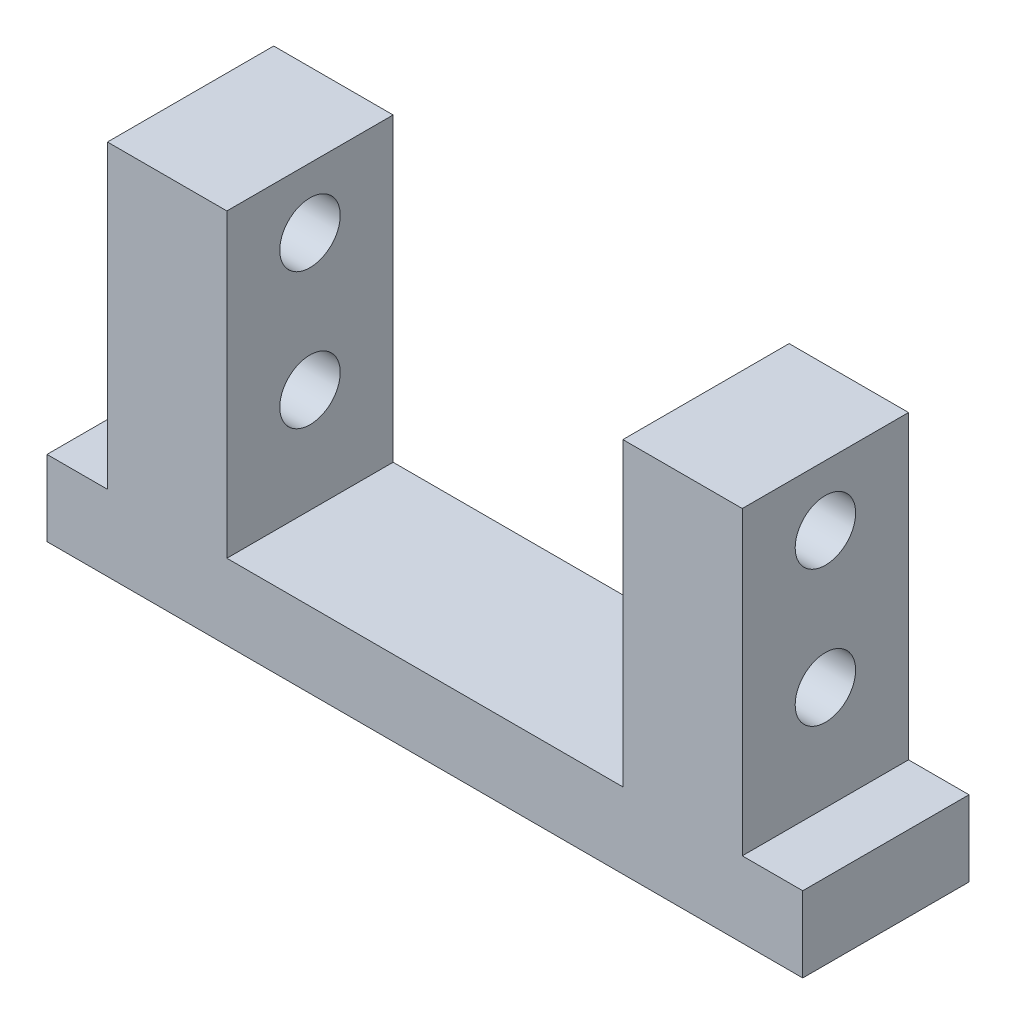
ISO-10303-21;
HEADER;
FILE_DESCRIPTION(('STEP AP214'),'2;1');
FILE_NAME('part.step','',(''),(''),'','','');
FILE_SCHEMA(('AUTOMOTIVE_DESIGN { 1 0 10303 214 1 1 1 1 }'));
ENDSEC;
DATA;
#1=APPLICATION_CONTEXT('core data for automotive mechanical design processes');
#2=APPLICATION_PROTOCOL_DEFINITION('international standard','automotive_design',2000,#1);
#3=PRODUCT_CONTEXT('',#1,'mechanical');
#4=PRODUCT('Part','Part','',(#3));
#5=PRODUCT_RELATED_PRODUCT_CATEGORY('part','',(#4));
#6=PRODUCT_DEFINITION_FORMATION('','',#4);
#7=PRODUCT_DEFINITION_CONTEXT('part definition',#1,'design');
#8=PRODUCT_DEFINITION('design','',#6,#7);
#9=PRODUCT_DEFINITION_SHAPE('','',#8);
#10=(LENGTH_UNIT() NAMED_UNIT(*) SI_UNIT(.MILLI.,.METRE.));
#11=(NAMED_UNIT(*) PLANE_ANGLE_UNIT() SI_UNIT($,.RADIAN.));
#12=(NAMED_UNIT(*) SI_UNIT($,.STERADIAN.) SOLID_ANGLE_UNIT());
#13=UNCERTAINTY_MEASURE_WITH_UNIT(LENGTH_MEASURE(1.E-05),#10,'distance_accuracy_value','');
#14=(GEOMETRIC_REPRESENTATION_CONTEXT(3) GLOBAL_UNCERTAINTY_ASSIGNED_CONTEXT((#13)) GLOBAL_UNIT_ASSIGNED_CONTEXT((#10,
#11,#12)) REPRESENTATION_CONTEXT('',''));
#15=CARTESIAN_POINT('',(0.,0.,0.));
#16=DIRECTION('',(0.,0.,1.));
#17=DIRECTION('',(1.,0.,0.));
#18=AXIS2_PLACEMENT_3D('',#15,#16,#17);
#19=CARTESIAN_POINT('',(0.,49.8,0.));
#20=DIRECTION('',(0.,1.,0.));
#21=DIRECTION('',(0.,0.,1.));
#22=AXIS2_PLACEMENT_3D('',#19,#20,#21);
#23=PLANE('',#22);
#24=DIRECTION('',(0.,0.,1.));
#25=VECTOR('',#24,1.);
#26=CARTESIAN_POINT('',(-26.2,49.8,11.));
#27=LINE('',#26,#25);
#28=CARTESIAN_POINT('',(-26.2,49.8,-11.));
#29=VERTEX_POINT('',#28);
#30=CARTESIAN_POINT('',(-26.2,49.8,11.));
#31=VERTEX_POINT('',#30);
#32=EDGE_CURVE('E131',#29,#31,#27,.T.);
#33=ORIENTED_EDGE('',*,*,#32,.F.);
#34=DIRECTION('',(-1.,0.,0.));
#35=VECTOR('',#34,1.);
#36=CARTESIAN_POINT('',(42.,49.8,-11.));
#37=LINE('',#36,#35);
#38=CARTESIAN_POINT('',(-42.,49.8,-11.));
#39=VERTEX_POINT('',#38);
#40=EDGE_CURVE('E172',#29,#39,#37,.T.);
#41=ORIENTED_EDGE('',*,*,#40,.T.);
#42=DIRECTION('',(0.,0.,1.));
#43=VECTOR('',#42,1.);
#44=CARTESIAN_POINT('',(-42.,49.8,11.));
#45=LINE('',#44,#43);
#46=CARTESIAN_POINT('',(-42.,49.8,11.));
#47=VERTEX_POINT('',#46);
#48=EDGE_CURVE('E164',#39,#47,#45,.T.);
#49=ORIENTED_EDGE('',*,*,#48,.T.);
#50=DIRECTION('',(1.,0.,0.));
#51=VECTOR('',#50,1.);
#52=CARTESIAN_POINT('',(42.,49.8,11.));
#53=LINE('',#52,#51);
#54=EDGE_CURVE('E168',#47,#31,#53,.T.);
#55=ORIENTED_EDGE('',*,*,#54,.T.);
#56=EDGE_LOOP('',(#33,#41,#49,#55));
#57=FACE_BOUND('',#56,.T.);
#58=ADVANCED_FACE('F35',(#57),#23,.T.);
#59=CARTESIAN_POINT('',(0.,10.,0.));
#60=DIRECTION('',(0.,-1.,0.));
#61=DIRECTION('',(0.,0.,-1.));
#62=AXIS2_PLACEMENT_3D('',#59,#60,#61);
#63=PLANE('',#62);
#64=DIRECTION('',(0.,0.,1.));
#65=VECTOR('',#64,1.);
#66=CARTESIAN_POINT('',(-42.,10.,11.));
#67=LINE('',#66,#65);
#68=CARTESIAN_POINT('',(-42.,10.,-11.));
#69=VERTEX_POINT('',#68);
#70=CARTESIAN_POINT('',(-42.,10.,11.));
#71=VERTEX_POINT('',#70);
#72=EDGE_CURVE('E159',#69,#71,#67,.T.);
#73=ORIENTED_EDGE('',*,*,#72,.F.);
#74=DIRECTION('',(-1.,0.,0.));
#75=VECTOR('',#74,1.);
#76=CARTESIAN_POINT('',(-50.,10.,-11.));
#77=LINE('',#76,#75);
#78=CARTESIAN_POINT('',(-50.,10.,-11.));
#79=VERTEX_POINT('',#78);
#80=EDGE_CURVE('E291',#69,#79,#77,.T.);
#81=ORIENTED_EDGE('',*,*,#80,.T.);
#82=DIRECTION('',(0.,0.,1.));
#83=VECTOR('',#82,1.);
#84=CARTESIAN_POINT('',(-50.,10.,11.));
#85=LINE('',#84,#83);
#86=CARTESIAN_POINT('',(-50.,10.,11.));
#87=VERTEX_POINT('',#86);
#88=EDGE_CURVE('E300',#79,#87,#85,.T.);
#89=ORIENTED_EDGE('',*,*,#88,.T.);
#90=DIRECTION('',(1.,0.,0.));
#91=VECTOR('',#90,1.);
#92=CARTESIAN_POINT('',(-50.,10.,11.));
#93=LINE('',#92,#91);
#94=EDGE_CURVE('E294',#87,#71,#93,.T.);
#95=ORIENTED_EDGE('',*,*,#94,.T.);
#96=EDGE_LOOP('',(#73,#81,#89,#95));
#97=FACE_BOUND('',#96,.T.);
#98=ADVANCED_FACE('F228',(#97),#63,.F.);
#99=DIRECTION('',(0.,0.,-1.));
#100=VECTOR('',#99,1.);
#101=CARTESIAN_POINT('',(42.,10.,11.));
#102=LINE('',#101,#100);
#103=CARTESIAN_POINT('',(42.,10.,11.));
#104=VERTEX_POINT('',#103);
#105=CARTESIAN_POINT('',(42.,10.,-11.));
#106=VERTEX_POINT('',#105);
#107=EDGE_CURVE('E60',#104,#106,#102,.T.);
#108=ORIENTED_EDGE('',*,*,#107,.F.);
#109=CARTESIAN_POINT('',(50.,10.,11.));
#110=VERTEX_POINT('',#109);
#111=EDGE_CURVE('E255',#104,#110,#93,.T.);
#112=ORIENTED_EDGE('',*,*,#111,.T.);
#113=DIRECTION('',(0.,0.,-1.));
#114=VECTOR('',#113,1.);
#115=CARTESIAN_POINT('',(50.,10.,11.));
#116=LINE('',#115,#114);
#117=CARTESIAN_POINT('',(50.,10.,-11.));
#118=VERTEX_POINT('',#117);
#119=EDGE_CURVE('E298',#110,#118,#116,.T.);
#120=ORIENTED_EDGE('',*,*,#119,.T.);
#121=EDGE_CURVE('E297',#118,#106,#77,.T.);
#122=ORIENTED_EDGE('',*,*,#121,.T.);
#123=EDGE_LOOP('',(#108,#112,#120,#122));
#124=FACE_BOUND('',#123,.T.);
#125=ADVANCED_FACE('F235',(#124),#63,.F.);
#126=CARTESIAN_POINT('',(50.,10.,11.));
#127=DIRECTION('',(-1.,0.,0.));
#128=DIRECTION('',(0.,0.,1.));
#129=AXIS2_PLACEMENT_3D('',#126,#127,#128);
#130=PLANE('',#129);
#131=DIRECTION('',(0.,0.,-1.));
#132=VECTOR('',#131,1.);
#133=CARTESIAN_POINT('',(50.,0.,11.));
#134=LINE('',#133,#132);
#135=CARTESIAN_POINT('',(50.,0.,11.));
#136=VERTEX_POINT('',#135);
#137=CARTESIAN_POINT('',(50.,0.,-11.));
#138=VERTEX_POINT('',#137);
#139=EDGE_CURVE('E313',#136,#138,#134,.T.);
#140=ORIENTED_EDGE('',*,*,#139,.T.);
#141=DIRECTION('',(0.,-1.,0.));
#142=VECTOR('',#141,1.);
#143=CARTESIAN_POINT('',(50.,10.,-11.));
#144=LINE('',#143,#142);
#145=EDGE_CURVE('E11',#118,#138,#144,.T.);
#146=ORIENTED_EDGE('',*,*,#145,.F.);
#147=ORIENTED_EDGE('',*,*,#119,.F.);
#148=DIRECTION('',(0.,-1.,0.));
#149=VECTOR('',#148,1.);
#150=CARTESIAN_POINT('',(50.,10.,11.));
#151=LINE('',#150,#149);
#152=EDGE_CURVE('E331',#110,#136,#151,.T.);
#153=ORIENTED_EDGE('',*,*,#152,.T.);
#154=EDGE_LOOP('',(#140,#146,#147,#153));
#155=FACE_BOUND('',#154,.T.);
#156=ADVANCED_FACE('F37',(#155),#130,.F.);
#157=CARTESIAN_POINT('',(-50.,10.,-11.));
#158=DIRECTION('',(0.,0.,1.));
#159=DIRECTION('',(1.,0.,0.));
#160=AXIS2_PLACEMENT_3D('',#157,#158,#159);
#161=PLANE('',#160);
#162=ORIENTED_EDGE('',*,*,#40,.F.);
#163=DIRECTION('',(0.,1.,0.));
#164=VECTOR('',#163,1.);
#165=CARTESIAN_POINT('',(-26.2,10.,-11.));
#166=LINE('',#165,#164);
#167=CARTESIAN_POINT('',(-26.2,10.,-11.));
#168=VERTEX_POINT('',#167);
#169=EDGE_CURVE('E157',#168,#29,#166,.T.);
#170=ORIENTED_EDGE('',*,*,#169,.F.);
#171=DIRECTION('',(-1.,0.,0.));
#172=VECTOR('',#171,1.);
#173=CARTESIAN_POINT('',(26.2,10.,-11.));
#174=LINE('',#173,#172);
#175=CARTESIAN_POINT('',(26.2,10.,-11.));
#176=VERTEX_POINT('',#175);
#177=EDGE_CURVE('E135',#176,#168,#174,.T.);
#178=ORIENTED_EDGE('',*,*,#177,.F.);
#179=DIRECTION('',(0.,1.,0.));
#180=VECTOR('',#179,1.);
#181=CARTESIAN_POINT('',(26.2,10.,-11.));
#182=LINE('',#181,#180);
#183=CARTESIAN_POINT('',(26.2,49.8,-11.));
#184=VERTEX_POINT('',#183);
#185=EDGE_CURVE('E160',#176,#184,#182,.T.);
#186=ORIENTED_EDGE('',*,*,#185,.T.);
#187=CARTESIAN_POINT('',(42.,49.8,-11.));
#188=VERTEX_POINT('',#187);
#189=EDGE_CURVE('E173',#188,#184,#37,.T.);
#190=ORIENTED_EDGE('',*,*,#189,.F.);
#191=DIRECTION('',(0.,-1.,0.));
#192=VECTOR('',#191,1.);
#193=CARTESIAN_POINT('',(42.,49.8,-11.));
#194=LINE('',#193,#192);
#195=EDGE_CURVE('E189',#188,#106,#194,.T.);
#196=ORIENTED_EDGE('',*,*,#195,.T.);
#197=ORIENTED_EDGE('',*,*,#121,.F.);
#198=ORIENTED_EDGE('',*,*,#145,.T.);
#199=DIRECTION('',(-1.,0.,0.));
#200=VECTOR('',#199,1.);
#201=CARTESIAN_POINT('',(-50.,0.,-11.));
#202=LINE('',#201,#200);
#203=CARTESIAN_POINT('',(-50.,0.,-11.));
#204=VERTEX_POINT('',#203);
#205=EDGE_CURVE('E322',#138,#204,#202,.T.);
#206=ORIENTED_EDGE('',*,*,#205,.T.);
#207=DIRECTION('',(0.,-1.,0.));
#208=VECTOR('',#207,1.);
#209=CARTESIAN_POINT('',(-50.,10.,-11.));
#210=LINE('',#209,#208);
#211=EDGE_CURVE('E44',#79,#204,#210,.T.);
#212=ORIENTED_EDGE('',*,*,#211,.F.);
#213=ORIENTED_EDGE('',*,*,#80,.F.);
#214=DIRECTION('',(0.,-1.,0.));
#215=VECTOR('',#214,1.);
#216=CARTESIAN_POINT('',(-42.,49.8,-11.));
#217=LINE('',#216,#215);
#218=EDGE_CURVE('E176',#39,#69,#217,.T.);
#219=ORIENTED_EDGE('',*,*,#218,.F.);
#220=EDGE_LOOP('',(#162,#170,#178,#186,#190,#196,#197,#198,#206,#212,#213,#219));
#221=FACE_BOUND('',#220,.T.);
#222=ADVANCED_FACE('F263',(#221),#161,.F.);
#223=CARTESIAN_POINT('',(-50.,10.,11.));
#224=DIRECTION('',(1.,0.,0.));
#225=DIRECTION('',(0.,0.,-1.));
#226=AXIS2_PLACEMENT_3D('',#223,#224,#225);
#227=PLANE('',#226);
#228=DIRECTION('',(0.,0.,1.));
#229=VECTOR('',#228,1.);
#230=CARTESIAN_POINT('',(-50.,0.,11.));
#231=LINE('',#230,#229);
#232=CARTESIAN_POINT('',(-50.,0.,11.));
#233=VERTEX_POINT('',#232);
#234=EDGE_CURVE('E327',#204,#233,#231,.T.);
#235=ORIENTED_EDGE('',*,*,#234,.T.);
#236=DIRECTION('',(0.,-1.,0.));
#237=VECTOR('',#236,1.);
#238=CARTESIAN_POINT('',(-50.,10.,11.));
#239=LINE('',#238,#237);
#240=EDGE_CURVE('E333',#87,#233,#239,.T.);
#241=ORIENTED_EDGE('',*,*,#240,.F.);
#242=ORIENTED_EDGE('',*,*,#88,.F.);
#243=ORIENTED_EDGE('',*,*,#211,.T.);
#244=EDGE_LOOP('',(#235,#241,#242,#243));
#245=FACE_BOUND('',#244,.T.);
#246=ADVANCED_FACE('F338',(#245),#227,.F.);
#247=CARTESIAN_POINT('',(-50.,10.,11.));
#248=DIRECTION('',(0.,0.,-1.));
#249=DIRECTION('',(-1.,0.,0.));
#250=AXIS2_PLACEMENT_3D('',#247,#248,#249);
#251=PLANE('',#250);
#252=DIRECTION('',(1.,0.,0.));
#253=VECTOR('',#252,1.);
#254=CARTESIAN_POINT('',(26.2,10.,11.));
#255=LINE('',#254,#253);
#256=CARTESIAN_POINT('',(-26.2,10.,11.));
#257=VERTEX_POINT('',#256);
#258=CARTESIAN_POINT('',(26.2,10.,11.));
#259=VERTEX_POINT('',#258);
#260=EDGE_CURVE('E141',#257,#259,#255,.T.);
#261=ORIENTED_EDGE('',*,*,#260,.F.);
#262=DIRECTION('',(0.,1.,0.));
#263=VECTOR('',#262,1.);
#264=CARTESIAN_POINT('',(-26.2,10.,11.));
#265=LINE('',#264,#263);
#266=EDGE_CURVE('E125',#257,#31,#265,.T.);
#267=ORIENTED_EDGE('',*,*,#266,.T.);
#268=ORIENTED_EDGE('',*,*,#54,.F.);
#269=DIRECTION('',(0.,-1.,0.));
#270=VECTOR('',#269,1.);
#271=CARTESIAN_POINT('',(-42.,49.8,11.));
#272=LINE('',#271,#270);
#273=EDGE_CURVE('E256',#47,#71,#272,.T.);
#274=ORIENTED_EDGE('',*,*,#273,.T.);
#275=ORIENTED_EDGE('',*,*,#94,.F.);
#276=ORIENTED_EDGE('',*,*,#240,.T.);
#277=DIRECTION('',(1.,0.,0.));
#278=VECTOR('',#277,1.);
#279=CARTESIAN_POINT('',(-50.,0.,11.));
#280=LINE('',#279,#278);
#281=EDGE_CURVE('E303',#233,#136,#280,.T.);
#282=ORIENTED_EDGE('',*,*,#281,.T.);
#283=ORIENTED_EDGE('',*,*,#152,.F.);
#284=ORIENTED_EDGE('',*,*,#111,.F.);
#285=DIRECTION('',(0.,-1.,0.));
#286=VECTOR('',#285,1.);
#287=CARTESIAN_POINT('',(42.,49.8,11.));
#288=LINE('',#287,#286);
#289=CARTESIAN_POINT('',(42.,49.8,11.));
#290=VERTEX_POINT('',#289);
#291=EDGE_CURVE('E252',#290,#104,#288,.T.);
#292=ORIENTED_EDGE('',*,*,#291,.F.);
#293=CARTESIAN_POINT('',(26.2,49.8,11.));
#294=VERTEX_POINT('',#293);
#295=EDGE_CURVE('E167',#294,#290,#53,.T.);
#296=ORIENTED_EDGE('',*,*,#295,.F.);
#297=DIRECTION('',(0.,1.,0.));
#298=VECTOR('',#297,1.);
#299=CARTESIAN_POINT('',(26.2,10.,11.));
#300=LINE('',#299,#298);
#301=EDGE_CURVE('E52',#259,#294,#300,.T.);
#302=ORIENTED_EDGE('',*,*,#301,.F.);
#303=EDGE_LOOP('',(#261,#267,#268,#274,#275,#276,#282,#283,#284,#292,#296,#302));
#304=FACE_BOUND('',#303,.T.);
#305=ADVANCED_FACE('F146',(#304),#251,.F.);
#306=CARTESIAN_POINT('',(0.,0.,0.));
#307=DIRECTION('',(0.,-1.,0.));
#308=DIRECTION('',(0.,0.,-1.));
#309=AXIS2_PLACEMENT_3D('',#306,#307,#308);
#310=PLANE('',#309);
#311=ORIENTED_EDGE('',*,*,#139,.F.);
#312=ORIENTED_EDGE('',*,*,#281,.F.);
#313=ORIENTED_EDGE('',*,*,#234,.F.);
#314=ORIENTED_EDGE('',*,*,#205,.F.);
#315=EDGE_LOOP('',(#311,#312,#313,#314));
#316=FACE_BOUND('',#315,.T.);
#317=ADVANCED_FACE('F283',(#316),#310,.T.);
#318=CARTESIAN_POINT('',(-42.,49.8,11.));
#319=DIRECTION('',(1.,0.,0.));
#320=DIRECTION('',(0.,0.,-1.));
#321=AXIS2_PLACEMENT_3D('',#318,#319,#320);
#322=PLANE('',#321);
#323=CARTESIAN_POINT('',(-42.,23.8,0.));
#324=DIRECTION('',(-1.,0.,0.));
#325=DIRECTION('',(0.,0.,1.));
#326=AXIS2_PLACEMENT_3D('',#323,#324,#325);
#327=CIRCLE('',#326,4.);
#328=CARTESIAN_POINT('',(-42.,23.8,4.));
#329=VERTEX_POINT('',#328);
#330=EDGE_CURVE('E272',#329,#329,#327,.T.);
#331=ORIENTED_EDGE('',*,*,#330,.F.);
#332=EDGE_LOOP('',(#331));
#333=FACE_BOUND('',#332,.T.);
#334=CARTESIAN_POINT('',(-42.,41.8,0.));
#335=DIRECTION('',(-1.,0.,0.));
#336=DIRECTION('',(0.,0.,1.));
#337=AXIS2_PLACEMENT_3D('',#334,#335,#336);
#338=CIRCLE('',#337,4.);
#339=CARTESIAN_POINT('',(-42.,41.8,4.));
#340=VERTEX_POINT('',#339);
#341=EDGE_CURVE('E194',#340,#340,#338,.T.);
#342=ORIENTED_EDGE('',*,*,#341,.F.);
#343=EDGE_LOOP('',(#342));
#344=FACE_BOUND('',#343,.T.);
#345=ORIENTED_EDGE('',*,*,#72,.T.);
#346=ORIENTED_EDGE('',*,*,#273,.F.);
#347=ORIENTED_EDGE('',*,*,#48,.F.);
#348=ORIENTED_EDGE('',*,*,#218,.T.);
#349=EDGE_LOOP('',(#345,#346,#347,#348));
#350=FACE_BOUND('',#349,.T.);
#351=ADVANCED_FACE('F247',(#333,#344,#350),#322,.F.);
#352=CARTESIAN_POINT('',(42.,49.8,11.));
#353=DIRECTION('',(-1.,0.,0.));
#354=DIRECTION('',(0.,0.,1.));
#355=AXIS2_PLACEMENT_3D('',#352,#353,#354);
#356=PLANE('',#355);
#357=CARTESIAN_POINT('',(42.,23.8,0.));
#358=DIRECTION('',(-1.,0.,0.));
#359=DIRECTION('',(0.,0.,1.));
#360=AXIS2_PLACEMENT_3D('',#357,#358,#359);
#361=CIRCLE('',#360,4.);
#362=CARTESIAN_POINT('',(42.,23.8,4.));
#363=VERTEX_POINT('',#362);
#364=EDGE_CURVE('E200',#363,#363,#361,.T.);
#365=ORIENTED_EDGE('',*,*,#364,.T.);
#366=EDGE_LOOP('',(#365));
#367=FACE_BOUND('',#366,.T.);
#368=CARTESIAN_POINT('',(42.,41.8,0.));
#369=DIRECTION('',(-1.,0.,0.));
#370=DIRECTION('',(0.,0.,1.));
#371=AXIS2_PLACEMENT_3D('',#368,#369,#370);
#372=CIRCLE('',#371,4.);
#373=CARTESIAN_POINT('',(42.,41.8,4.));
#374=VERTEX_POINT('',#373);
#375=EDGE_CURVE('E155',#374,#374,#372,.T.);
#376=ORIENTED_EDGE('',*,*,#375,.T.);
#377=EDGE_LOOP('',(#376));
#378=FACE_BOUND('',#377,.T.);
#379=ORIENTED_EDGE('',*,*,#107,.T.);
#380=ORIENTED_EDGE('',*,*,#195,.F.);
#381=DIRECTION('',(0.,0.,-1.));
#382=VECTOR('',#381,1.);
#383=CARTESIAN_POINT('',(42.,49.8,11.));
#384=LINE('',#383,#382);
#385=EDGE_CURVE('E170',#290,#188,#384,.T.);
#386=ORIENTED_EDGE('',*,*,#385,.F.);
#387=ORIENTED_EDGE('',*,*,#291,.T.);
#388=EDGE_LOOP('',(#379,#380,#386,#387));
#389=FACE_BOUND('',#388,.T.);
#390=ADVANCED_FACE('F211',(#367,#378,#389),#356,.F.);
#391=DIRECTION('',(0.,0.,-1.));
#392=VECTOR('',#391,1.);
#393=CARTESIAN_POINT('',(26.2,49.8,11.));
#394=LINE('',#393,#392);
#395=EDGE_CURVE('E144',#294,#184,#394,.T.);
#396=ORIENTED_EDGE('',*,*,#395,.F.);
#397=ORIENTED_EDGE('',*,*,#295,.T.);
#398=ORIENTED_EDGE('',*,*,#385,.T.);
#399=ORIENTED_EDGE('',*,*,#189,.T.);
#400=EDGE_LOOP('',(#396,#397,#398,#399));
#401=FACE_BOUND('',#400,.T.);
#402=ADVANCED_FACE('F231',(#401),#23,.T.);
#403=CARTESIAN_POINT('',(-26.2,10.,11.));
#404=DIRECTION('',(-1.,0.,0.));
#405=DIRECTION('',(0.,0.,1.));
#406=AXIS2_PLACEMENT_3D('',#403,#404,#405);
#407=PLANE('',#406);
#408=CARTESIAN_POINT('',(-26.2,23.8,0.));
#409=DIRECTION('',(-1.,0.,0.));
#410=DIRECTION('',(0.,0.,1.));
#411=AXIS2_PLACEMENT_3D('',#408,#409,#410);
#412=CIRCLE('',#411,4.);
#413=CARTESIAN_POINT('',(-26.2,23.8,4.));
#414=VERTEX_POINT('',#413);
#415=EDGE_CURVE('E205',#414,#414,#412,.T.);
#416=ORIENTED_EDGE('',*,*,#415,.T.);
#417=EDGE_LOOP('',(#416));
#418=FACE_BOUND('',#417,.T.);
#419=CARTESIAN_POINT('',(-26.2,41.8,0.));
#420=DIRECTION('',(-1.,0.,0.));
#421=DIRECTION('',(0.,0.,1.));
#422=AXIS2_PLACEMENT_3D('',#419,#420,#421);
#423=CIRCLE('',#422,4.);
#424=CARTESIAN_POINT('',(-26.2,41.8,4.));
#425=VERTEX_POINT('',#424);
#426=EDGE_CURVE('E193',#425,#425,#423,.T.);
#427=ORIENTED_EDGE('',*,*,#426,.T.);
#428=EDGE_LOOP('',(#427));
#429=FACE_BOUND('',#428,.T.);
#430=ORIENTED_EDGE('',*,*,#32,.T.);
#431=ORIENTED_EDGE('',*,*,#266,.F.);
#432=DIRECTION('',(0.,0.,1.));
#433=VECTOR('',#432,1.);
#434=CARTESIAN_POINT('',(-26.2,10.,11.));
#435=LINE('',#434,#433);
#436=EDGE_CURVE('E128',#168,#257,#435,.T.);
#437=ORIENTED_EDGE('',*,*,#436,.F.);
#438=ORIENTED_EDGE('',*,*,#169,.T.);
#439=EDGE_LOOP('',(#430,#431,#437,#438));
#440=FACE_BOUND('',#439,.T.);
#441=ADVANCED_FACE('F127',(#418,#429,#440),#407,.F.);
#442=CARTESIAN_POINT('',(26.2,10.,11.));
#443=DIRECTION('',(1.,0.,0.));
#444=DIRECTION('',(0.,0.,-1.));
#445=AXIS2_PLACEMENT_3D('',#442,#443,#444);
#446=PLANE('',#445);
#447=CARTESIAN_POINT('',(26.2,23.8,0.));
#448=DIRECTION('',(1.,0.,0.));
#449=DIRECTION('',(0.,0.,-1.));
#450=AXIS2_PLACEMENT_3D('',#447,#448,#449);
#451=CIRCLE('',#450,4.);
#452=CARTESIAN_POINT('',(26.2,23.8,-4.));
#453=VERTEX_POINT('',#452);
#454=EDGE_CURVE('E39',#453,#453,#451,.T.);
#455=ORIENTED_EDGE('',*,*,#454,.T.);
#456=EDGE_LOOP('',(#455));
#457=FACE_BOUND('',#456,.T.);
#458=CARTESIAN_POINT('',(26.2,41.8,0.));
#459=DIRECTION('',(1.,0.,0.));
#460=DIRECTION('',(0.,0.,-1.));
#461=AXIS2_PLACEMENT_3D('',#458,#459,#460);
#462=CIRCLE('',#461,4.);
#463=CARTESIAN_POINT('',(26.2,41.8,-4.));
#464=VERTEX_POINT('',#463);
#465=EDGE_CURVE('E191',#464,#464,#462,.T.);
#466=ORIENTED_EDGE('',*,*,#465,.T.);
#467=EDGE_LOOP('',(#466));
#468=FACE_BOUND('',#467,.T.);
#469=ORIENTED_EDGE('',*,*,#395,.T.);
#470=ORIENTED_EDGE('',*,*,#185,.F.);
#471=DIRECTION('',(0.,0.,-1.));
#472=VECTOR('',#471,1.);
#473=CARTESIAN_POINT('',(26.2,10.,11.));
#474=LINE('',#473,#472);
#475=EDGE_CURVE('E148',#259,#176,#474,.T.);
#476=ORIENTED_EDGE('',*,*,#475,.F.);
#477=ORIENTED_EDGE('',*,*,#301,.T.);
#478=EDGE_LOOP('',(#469,#470,#476,#477));
#479=FACE_BOUND('',#478,.T.);
#480=ADVANCED_FACE('F224',(#457,#468,#479),#446,.F.);
#481=CARTESIAN_POINT('',(0.,10.,0.));
#482=DIRECTION('',(0.,1.,0.));
#483=DIRECTION('',(0.,0.,1.));
#484=AXIS2_PLACEMENT_3D('',#481,#482,#483);
#485=PLANE('',#484);
#486=ORIENTED_EDGE('',*,*,#436,.T.);
#487=ORIENTED_EDGE('',*,*,#260,.T.);
#488=ORIENTED_EDGE('',*,*,#475,.T.);
#489=ORIENTED_EDGE('',*,*,#177,.T.);
#490=EDGE_LOOP('',(#486,#487,#488,#489));
#491=FACE_BOUND('',#490,.T.);
#492=ADVANCED_FACE('F139',(#491),#485,.T.);
#493=CARTESIAN_POINT('',(50.000025,41.8,0.));
#494=DIRECTION('',(-1.,0.,0.));
#495=DIRECTION('',(0.,0.,1.));
#496=AXIS2_PLACEMENT_3D('',#493,#494,#495);
#497=CYLINDRICAL_SURFACE('',#496,4.);
#498=ORIENTED_EDGE('',*,*,#465,.F.);
#499=EDGE_LOOP('',(#498));
#500=FACE_BOUND('',#499,.T.);
#501=ORIENTED_EDGE('',*,*,#375,.F.);
#502=EDGE_LOOP('',(#501));
#503=FACE_BOUND('',#502,.T.);
#504=ADVANCED_FACE('F214',(#500,#503),#497,.F.);
#505=ORIENTED_EDGE('',*,*,#341,.T.);
#506=EDGE_LOOP('',(#505));
#507=FACE_BOUND('',#506,.T.);
#508=ORIENTED_EDGE('',*,*,#426,.F.);
#509=EDGE_LOOP('',(#508));
#510=FACE_BOUND('',#509,.T.);
#511=ADVANCED_FACE('F216',(#507,#510),#497,.F.);
#512=CARTESIAN_POINT('',(50.000025,23.8,0.));
#513=DIRECTION('',(-1.,0.,0.));
#514=DIRECTION('',(0.,0.,1.));
#515=AXIS2_PLACEMENT_3D('',#512,#513,#514);
#516=CYLINDRICAL_SURFACE('',#515,4.);
#517=ORIENTED_EDGE('',*,*,#454,.F.);
#518=EDGE_LOOP('',(#517));
#519=FACE_BOUND('',#518,.T.);
#520=ORIENTED_EDGE('',*,*,#364,.F.);
#521=EDGE_LOOP('',(#520));
#522=FACE_BOUND('',#521,.T.);
#523=ADVANCED_FACE('F223',(#519,#522),#516,.F.);
#524=ORIENTED_EDGE('',*,*,#330,.T.);
#525=EDGE_LOOP('',(#524));
#526=FACE_BOUND('',#525,.T.);
#527=ORIENTED_EDGE('',*,*,#415,.F.);
#528=EDGE_LOOP('',(#527));
#529=FACE_BOUND('',#528,.T.);
#530=ADVANCED_FACE('F278',(#526,#529),#516,.F.);
#531=CLOSED_SHELL('',(#58,#98,#125,#156,#222,#246,#305,#317,#351,#390,#402,#441,#480,#492,#504,
#511,#523,#530));
#532=MANIFOLD_SOLID_BREP('B2',#531);
#533=ADVANCED_BREP_SHAPE_REPRESENTATION('',(#18,#532),#14);
#534=SHAPE_DEFINITION_REPRESENTATION(#9,#533);
ENDSEC;
END-ISO-10303-21;
